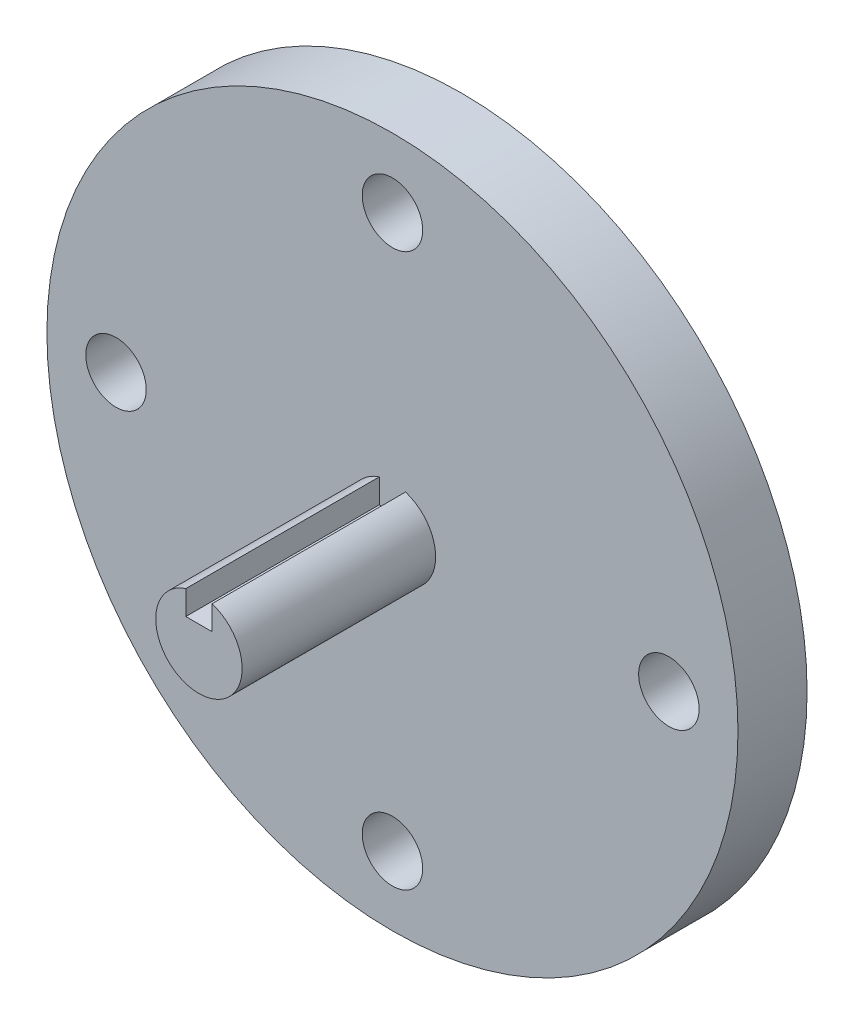
ISO-10303-21;
HEADER;
FILE_DESCRIPTION(('STEP AP214'),'2;1');
FILE_NAME('part.step','',(''),(''),'','','');
FILE_SCHEMA(('AUTOMOTIVE_DESIGN { 1 0 10303 214 1 1 1 1 }'));
ENDSEC;
DATA;
#1=APPLICATION_CONTEXT('core data for automotive mechanical design processes');
#2=APPLICATION_PROTOCOL_DEFINITION('international standard','automotive_design',2000,#1);
#3=PRODUCT_CONTEXT('',#1,'mechanical');
#4=PRODUCT('Part','Part','',(#3));
#5=PRODUCT_RELATED_PRODUCT_CATEGORY('part','',(#4));
#6=PRODUCT_DEFINITION_FORMATION('','',#4);
#7=PRODUCT_DEFINITION_CONTEXT('part definition',#1,'design');
#8=PRODUCT_DEFINITION('design','',#6,#7);
#9=PRODUCT_DEFINITION_SHAPE('','',#8);
#10=(LENGTH_UNIT() NAMED_UNIT(*) SI_UNIT(.MILLI.,.METRE.));
#11=(NAMED_UNIT(*) PLANE_ANGLE_UNIT() SI_UNIT($,.RADIAN.));
#12=(NAMED_UNIT(*) SI_UNIT($,.STERADIAN.) SOLID_ANGLE_UNIT());
#13=UNCERTAINTY_MEASURE_WITH_UNIT(LENGTH_MEASURE(1.E-05),#10,'distance_accuracy_value','');
#14=(GEOMETRIC_REPRESENTATION_CONTEXT(3) GLOBAL_UNCERTAINTY_ASSIGNED_CONTEXT((#13)) GLOBAL_UNIT_ASSIGNED_CONTEXT((#10,
#11,#12)) REPRESENTATION_CONTEXT('',''));
#15=CARTESIAN_POINT('',(0.,0.,0.));
#16=DIRECTION('',(0.,0.,1.));
#17=DIRECTION('',(1.,0.,0.));
#18=AXIS2_PLACEMENT_3D('',#15,#16,#17);
#19=CARTESIAN_POINT('',(0.,0.,12.7));
#20=DIRECTION('',(0.,0.,1.));
#21=DIRECTION('',(1.,0.,0.));
#22=AXIS2_PLACEMENT_3D('',#19,#20,#21);
#23=PLANE('',#22);
#24=CARTESIAN_POINT('',(0.,0.,12.7));
#25=DIRECTION('',(0.,0.,1.));
#26=DIRECTION('',(1.,0.,0.));
#27=AXIS2_PLACEMENT_3D('',#24,#25,#26);
#28=CIRCLE('',#27,7.9375);
#29=CARTESIAN_POINT('',(-2.413,7.56183425168788,12.7));
#30=VERTEX_POINT('',#29);
#31=CARTESIAN_POINT('',(2.413,7.56183425168788,12.7));
#32=VERTEX_POINT('',#31);
#33=EDGE_CURVE('E124',#30,#32,#28,.T.);
#34=ORIENTED_EDGE('',*,*,#33,.F.);
#35=DIRECTION('',(0.,1.,0.));
#36=VECTOR('',#35,1.);
#37=CARTESIAN_POINT('',(-2.413,0.,12.7));
#38=LINE('',#37,#36);
#39=CARTESIAN_POINT('',(-2.413,3.1115,12.7));
#40=VERTEX_POINT('',#39);
#41=EDGE_CURVE('E93',#40,#30,#38,.T.);
#42=ORIENTED_EDGE('',*,*,#41,.F.);
#43=DIRECTION('',(-1.,0.,0.));
#44=VECTOR('',#43,1.);
#45=CARTESIAN_POINT('',(0.,3.1115,12.7));
#46=LINE('',#45,#44);
#47=CARTESIAN_POINT('',(2.413,3.1115,12.7));
#48=VERTEX_POINT('',#47);
#49=EDGE_CURVE('E68',#48,#40,#46,.T.);
#50=ORIENTED_EDGE('',*,*,#49,.F.);
#51=DIRECTION('',(0.,-1.,0.));
#52=VECTOR('',#51,1.);
#53=CARTESIAN_POINT('',(2.413,0.,12.7));
#54=LINE('',#53,#52);
#55=EDGE_CURVE('E63',#32,#48,#54,.T.);
#56=ORIENTED_EDGE('',*,*,#55,.F.);
#57=EDGE_LOOP('',(#34,#42,#50,#56));
#58=FACE_BOUND('',#57,.T.);
#59=CARTESIAN_POINT('',(50.8,-3.54734504026462E-13,12.7));
#60=DIRECTION('',(0.,0.,1.));
#61=DIRECTION('',(1.,0.,0.));
#62=AXIS2_PLACEMENT_3D('',#59,#60,#61);
#63=CIRCLE('',#62,5.55625);
#64=CARTESIAN_POINT('',(56.35625,-3.54734504026462E-13,12.7));
#65=VERTEX_POINT('',#64);
#66=EDGE_CURVE('E133',#65,#65,#63,.T.);
#67=ORIENTED_EDGE('',*,*,#66,.F.);
#68=EDGE_LOOP('',(#67));
#69=FACE_BOUND('',#68,.T.);
#70=CARTESIAN_POINT('',(-50.8,0.,12.7));
#71=DIRECTION('',(0.,0.,1.));
#72=DIRECTION('',(1.,0.,0.));
#73=AXIS2_PLACEMENT_3D('',#70,#71,#72);
#74=CIRCLE('',#73,5.55625);
#75=CARTESIAN_POINT('',(-45.24375,0.,12.7));
#76=VERTEX_POINT('',#75);
#77=EDGE_CURVE('E145',#76,#76,#74,.T.);
#78=ORIENTED_EDGE('',*,*,#77,.F.);
#79=EDGE_LOOP('',(#78));
#80=FACE_BOUND('',#79,.T.);
#81=CARTESIAN_POINT('',(0.,0.,12.7));
#82=DIRECTION('',(0.,0.,1.));
#83=DIRECTION('',(1.,0.,0.));
#84=AXIS2_PLACEMENT_3D('',#81,#82,#83);
#85=CIRCLE('',#84,63.5);
#86=CARTESIAN_POINT('',(63.5,0.,12.7));
#87=VERTEX_POINT('',#86);
#88=EDGE_CURVE('E13',#87,#87,#85,.T.);
#89=ORIENTED_EDGE('',*,*,#88,.T.);
#90=EDGE_LOOP('',(#89));
#91=FACE_BOUND('',#90,.T.);
#92=CARTESIAN_POINT('',(1.77367252013231E-13,50.8,12.7));
#93=DIRECTION('',(0.,0.,1.));
#94=DIRECTION('',(1.,0.,0.));
#95=AXIS2_PLACEMENT_3D('',#92,#93,#94);
#96=CIRCLE('',#95,5.55625);
#97=CARTESIAN_POINT('',(5.55625000000017,50.8,12.7));
#98=VERTEX_POINT('',#97);
#99=EDGE_CURVE('E139',#98,#98,#96,.T.);
#100=ORIENTED_EDGE('',*,*,#99,.F.);
#101=EDGE_LOOP('',(#100));
#102=FACE_BOUND('',#101,.T.);
#103=CARTESIAN_POINT('',(-5.32101756039693E-13,-50.8,12.7));
#104=DIRECTION('',(0.,0.,1.));
#105=DIRECTION('',(1.,0.,0.));
#106=AXIS2_PLACEMENT_3D('',#103,#104,#105);
#107=CIRCLE('',#106,5.55624999999999);
#108=CARTESIAN_POINT('',(5.55624999999946,-50.8,12.7));
#109=VERTEX_POINT('',#108);
#110=EDGE_CURVE('E127',#109,#109,#107,.T.);
#111=ORIENTED_EDGE('',*,*,#110,.F.);
#112=EDGE_LOOP('',(#111));
#113=FACE_BOUND('',#112,.T.);
#114=ADVANCED_FACE('F48',(#58,#69,#80,#91,#102,#113),#23,.T.);
#115=CARTESIAN_POINT('',(0.,0.,0.));
#116=DIRECTION('',(0.,0.,1.));
#117=DIRECTION('',(1.,0.,0.));
#118=AXIS2_PLACEMENT_3D('',#115,#116,#117);
#119=PLANE('',#118);
#120=CARTESIAN_POINT('',(0.,0.,0.));
#121=DIRECTION('',(0.,0.,1.));
#122=DIRECTION('',(1.,0.,0.));
#123=AXIS2_PLACEMENT_3D('',#120,#121,#122);
#124=CIRCLE('',#123,63.5);
#125=CARTESIAN_POINT('',(63.5,0.,0.));
#126=VERTEX_POINT('',#125);
#127=EDGE_CURVE('E52',#126,#126,#124,.T.);
#128=ORIENTED_EDGE('',*,*,#127,.F.);
#129=EDGE_LOOP('',(#128));
#130=FACE_BOUND('',#129,.T.);
#131=CARTESIAN_POINT('',(-50.8,0.,0.));
#132=DIRECTION('',(0.,0.,1.));
#133=DIRECTION('',(1.,0.,0.));
#134=AXIS2_PLACEMENT_3D('',#131,#132,#133);
#135=CIRCLE('',#134,5.55625);
#136=CARTESIAN_POINT('',(-45.24375,0.,0.));
#137=VERTEX_POINT('',#136);
#138=EDGE_CURVE('E142',#137,#137,#135,.T.);
#139=ORIENTED_EDGE('',*,*,#138,.T.);
#140=EDGE_LOOP('',(#139));
#141=FACE_BOUND('',#140,.T.);
#142=CARTESIAN_POINT('',(1.77367252013231E-13,50.8,0.));
#143=DIRECTION('',(0.,0.,1.));
#144=DIRECTION('',(1.,0.,0.));
#145=AXIS2_PLACEMENT_3D('',#142,#143,#144);
#146=CIRCLE('',#145,5.55625);
#147=CARTESIAN_POINT('',(5.55625000000017,50.8,0.));
#148=VERTEX_POINT('',#147);
#149=EDGE_CURVE('E136',#148,#148,#146,.T.);
#150=ORIENTED_EDGE('',*,*,#149,.T.);
#151=EDGE_LOOP('',(#150));
#152=FACE_BOUND('',#151,.T.);
#153=CARTESIAN_POINT('',(50.8,-3.54734504026462E-13,0.));
#154=DIRECTION('',(0.,0.,1.));
#155=DIRECTION('',(1.,0.,0.));
#156=AXIS2_PLACEMENT_3D('',#153,#154,#155);
#157=CIRCLE('',#156,5.55625);
#158=CARTESIAN_POINT('',(56.35625,-3.54734504026462E-13,0.));
#159=VERTEX_POINT('',#158);
#160=EDGE_CURVE('E130',#159,#159,#157,.T.);
#161=ORIENTED_EDGE('',*,*,#160,.T.);
#162=EDGE_LOOP('',(#161));
#163=FACE_BOUND('',#162,.T.);
#164=CARTESIAN_POINT('',(-5.32101756039693E-13,-50.8,0.));
#165=DIRECTION('',(0.,0.,1.));
#166=DIRECTION('',(1.,0.,0.));
#167=AXIS2_PLACEMENT_3D('',#164,#165,#166);
#168=CIRCLE('',#167,5.55624999999999);
#169=CARTESIAN_POINT('',(5.55624999999946,-50.8,0.));
#170=VERTEX_POINT('',#169);
#171=EDGE_CURVE('E126',#170,#170,#168,.T.);
#172=ORIENTED_EDGE('',*,*,#171,.T.);
#173=EDGE_LOOP('',(#172));
#174=FACE_BOUND('',#173,.T.);
#175=ADVANCED_FACE('F151',(#130,#141,#152,#163,#174),#119,.F.);
#176=CARTESIAN_POINT('',(0.,0.,12.7));
#177=DIRECTION('',(0.,0.,-1.));
#178=DIRECTION('',(-1.,0.,0.));
#179=AXIS2_PLACEMENT_3D('',#176,#177,#178);
#180=CYLINDRICAL_SURFACE('',#179,63.5);
#181=ORIENTED_EDGE('',*,*,#88,.F.);
#182=EDGE_LOOP('',(#181));
#183=FACE_BOUND('',#182,.T.);
#184=ORIENTED_EDGE('',*,*,#127,.T.);
#185=EDGE_LOOP('',(#184));
#186=FACE_BOUND('',#185,.T.);
#187=ADVANCED_FACE('F50',(#183,#186),#180,.T.);
#188=CARTESIAN_POINT('',(-50.8,0.,12.7));
#189=DIRECTION('',(0.,0.,-1.));
#190=DIRECTION('',(-1.,0.,0.));
#191=AXIS2_PLACEMENT_3D('',#188,#189,#190);
#192=CYLINDRICAL_SURFACE('',#191,5.55625);
#193=ORIENTED_EDGE('',*,*,#77,.T.);
#194=EDGE_LOOP('',(#193));
#195=FACE_BOUND('',#194,.T.);
#196=ORIENTED_EDGE('',*,*,#138,.F.);
#197=EDGE_LOOP('',(#196));
#198=FACE_BOUND('',#197,.T.);
#199=ADVANCED_FACE('F154',(#195,#198),#192,.F.);
#200=CARTESIAN_POINT('',(1.77367252013231E-13,50.8,12.7));
#201=DIRECTION('',(0.,0.,-1.));
#202=DIRECTION('',(-1.,0.,0.));
#203=AXIS2_PLACEMENT_3D('',#200,#201,#202);
#204=CYLINDRICAL_SURFACE('',#203,5.55625);
#205=ORIENTED_EDGE('',*,*,#99,.T.);
#206=EDGE_LOOP('',(#205));
#207=FACE_BOUND('',#206,.T.);
#208=ORIENTED_EDGE('',*,*,#149,.F.);
#209=EDGE_LOOP('',(#208));
#210=FACE_BOUND('',#209,.T.);
#211=ADVANCED_FACE('F156',(#207,#210),#204,.F.);
#212=CARTESIAN_POINT('',(50.8,-3.54734504026462E-13,12.7));
#213=DIRECTION('',(0.,0.,-1.));
#214=DIRECTION('',(-1.,0.,0.));
#215=AXIS2_PLACEMENT_3D('',#212,#213,#214);
#216=CYLINDRICAL_SURFACE('',#215,5.55625);
#217=ORIENTED_EDGE('',*,*,#66,.T.);
#218=EDGE_LOOP('',(#217));
#219=FACE_BOUND('',#218,.T.);
#220=ORIENTED_EDGE('',*,*,#160,.F.);
#221=EDGE_LOOP('',(#220));
#222=FACE_BOUND('',#221,.T.);
#223=ADVANCED_FACE('F163',(#219,#222),#216,.F.);
#224=CARTESIAN_POINT('',(-5.32101756039693E-13,-50.8,12.7));
#225=DIRECTION('',(0.,0.,-1.));
#226=DIRECTION('',(-1.,0.,0.));
#227=AXIS2_PLACEMENT_3D('',#224,#225,#226);
#228=CYLINDRICAL_SURFACE('',#227,5.55624999999999);
#229=ORIENTED_EDGE('',*,*,#110,.T.);
#230=EDGE_LOOP('',(#229));
#231=FACE_BOUND('',#230,.T.);
#232=ORIENTED_EDGE('',*,*,#171,.F.);
#233=EDGE_LOOP('',(#232));
#234=FACE_BOUND('',#233,.T.);
#235=ADVANCED_FACE('F184',(#231,#234),#228,.F.);
#236=CARTESIAN_POINT('',(0.,0.,48.26));
#237=DIRECTION('',(0.,0.,-1.));
#238=DIRECTION('',(-1.,0.,0.));
#239=AXIS2_PLACEMENT_3D('',#236,#237,#238);
#240=CYLINDRICAL_SURFACE('',#239,7.9375);
#241=DIRECTION('',(0.,0.,-1.));
#242=VECTOR('',#241,1.);
#243=CARTESIAN_POINT('',(-2.413,7.56183425168788,48.26));
#244=LINE('',#243,#242);
#245=CARTESIAN_POINT('',(-2.413,7.56183425168788,48.26));
#246=VERTEX_POINT('',#245);
#247=EDGE_CURVE('E88',#246,#30,#244,.T.);
#248=ORIENTED_EDGE('',*,*,#247,.T.);
#249=ORIENTED_EDGE('',*,*,#33,.T.);
#250=DIRECTION('',(0.,0.,-1.));
#251=VECTOR('',#250,1.);
#252=CARTESIAN_POINT('',(2.413,7.56183425168788,48.26));
#253=LINE('',#252,#251);
#254=CARTESIAN_POINT('',(2.413,7.56183425168788,48.26));
#255=VERTEX_POINT('',#254);
#256=EDGE_CURVE('E111',#255,#32,#253,.T.);
#257=ORIENTED_EDGE('',*,*,#256,.F.);
#258=CARTESIAN_POINT('',(0.,0.,48.26));
#259=DIRECTION('',(0.,0.,-1.));
#260=DIRECTION('',(-1.,0.,0.));
#261=AXIS2_PLACEMENT_3D('',#258,#259,#260);
#262=CIRCLE('',#261,7.9375);
#263=EDGE_CURVE('E104',#255,#246,#262,.T.);
#264=ORIENTED_EDGE('',*,*,#263,.T.);
#265=EDGE_LOOP('',(#248,#249,#257,#264));
#266=FACE_BOUND('',#265,.T.);
#267=ADVANCED_FACE('F109',(#266),#240,.T.);
#268=CARTESIAN_POINT('',(2.413,7.56183425168788,48.26));
#269=DIRECTION('',(-1.,0.,0.));
#270=DIRECTION('',(0.,-1.,0.));
#271=AXIS2_PLACEMENT_3D('',#268,#269,#270);
#272=PLANE('',#271);
#273=ORIENTED_EDGE('',*,*,#256,.T.);
#274=ORIENTED_EDGE('',*,*,#55,.T.);
#275=DIRECTION('',(0.,0.,-1.));
#276=VECTOR('',#275,1.);
#277=CARTESIAN_POINT('',(2.413,3.1115,48.26));
#278=LINE('',#277,#276);
#279=CARTESIAN_POINT('',(2.413,3.1115,48.26));
#280=VERTEX_POINT('',#279);
#281=EDGE_CURVE('E117',#280,#48,#278,.T.);
#282=ORIENTED_EDGE('',*,*,#281,.F.);
#283=DIRECTION('',(0.,1.,0.));
#284=VECTOR('',#283,1.);
#285=CARTESIAN_POINT('',(2.413,7.56183425168788,48.26));
#286=LINE('',#285,#284);
#287=EDGE_CURVE('E97',#280,#255,#286,.T.);
#288=ORIENTED_EDGE('',*,*,#287,.T.);
#289=EDGE_LOOP('',(#273,#274,#282,#288));
#290=FACE_BOUND('',#289,.T.);
#291=ADVANCED_FACE('F194',(#290),#272,.T.);
#292=CARTESIAN_POINT('',(2.413,3.1115,48.26));
#293=DIRECTION('',(0.,1.,0.));
#294=DIRECTION('',(0.,0.,1.));
#295=AXIS2_PLACEMENT_3D('',#292,#293,#294);
#296=PLANE('',#295);
#297=ORIENTED_EDGE('',*,*,#281,.T.);
#298=ORIENTED_EDGE('',*,*,#49,.T.);
#299=DIRECTION('',(0.,0.,-1.));
#300=VECTOR('',#299,1.);
#301=CARTESIAN_POINT('',(-2.413,3.1115,48.26));
#302=LINE('',#301,#300);
#303=CARTESIAN_POINT('',(-2.413,3.1115,48.26));
#304=VERTEX_POINT('',#303);
#305=EDGE_CURVE('E96',#304,#40,#302,.T.);
#306=ORIENTED_EDGE('',*,*,#305,.F.);
#307=DIRECTION('',(1.,0.,0.));
#308=VECTOR('',#307,1.);
#309=CARTESIAN_POINT('',(2.413,3.1115,48.26));
#310=LINE('',#309,#308);
#311=EDGE_CURVE('E107',#304,#280,#310,.T.);
#312=ORIENTED_EDGE('',*,*,#311,.T.);
#313=EDGE_LOOP('',(#297,#298,#306,#312));
#314=FACE_BOUND('',#313,.T.);
#315=ADVANCED_FACE('F201',(#314),#296,.T.);
#316=CARTESIAN_POINT('',(-2.413,3.1115,48.26));
#317=DIRECTION('',(1.,0.,0.));
#318=DIRECTION('',(0.,0.,-1.));
#319=AXIS2_PLACEMENT_3D('',#316,#317,#318);
#320=PLANE('',#319);
#321=ORIENTED_EDGE('',*,*,#305,.T.);
#322=ORIENTED_EDGE('',*,*,#41,.T.);
#323=ORIENTED_EDGE('',*,*,#247,.F.);
#324=DIRECTION('',(0.,-1.,0.));
#325=VECTOR('',#324,1.);
#326=CARTESIAN_POINT('',(-2.413,3.1115,48.26));
#327=LINE('',#326,#325);
#328=EDGE_CURVE('E92',#246,#304,#327,.T.);
#329=ORIENTED_EDGE('',*,*,#328,.T.);
#330=EDGE_LOOP('',(#321,#322,#323,#329));
#331=FACE_BOUND('',#330,.T.);
#332=ADVANCED_FACE('F91',(#331),#320,.T.);
#333=CARTESIAN_POINT('',(0.,0.,48.26));
#334=DIRECTION('',(0.,0.,-1.));
#335=DIRECTION('',(-1.,0.,0.));
#336=AXIS2_PLACEMENT_3D('',#333,#334,#335);
#337=PLANE('',#336);
#338=ORIENTED_EDGE('',*,*,#263,.F.);
#339=ORIENTED_EDGE('',*,*,#287,.F.);
#340=ORIENTED_EDGE('',*,*,#311,.F.);
#341=ORIENTED_EDGE('',*,*,#328,.F.);
#342=EDGE_LOOP('',(#338,#339,#340,#341));
#343=FACE_BOUND('',#342,.T.);
#344=ADVANCED_FACE('F102',(#343),#337,.F.);
#345=CLOSED_SHELL('',(#114,#175,#187,#199,#211,#223,#235,#267,#291,#315,#332,#344));
#346=MANIFOLD_SOLID_BREP('B2',#345);
#347=ADVANCED_BREP_SHAPE_REPRESENTATION('',(#18,#346),#14);
#348=SHAPE_DEFINITION_REPRESENTATION(#9,#347);
ENDSEC;
END-ISO-10303-21;
